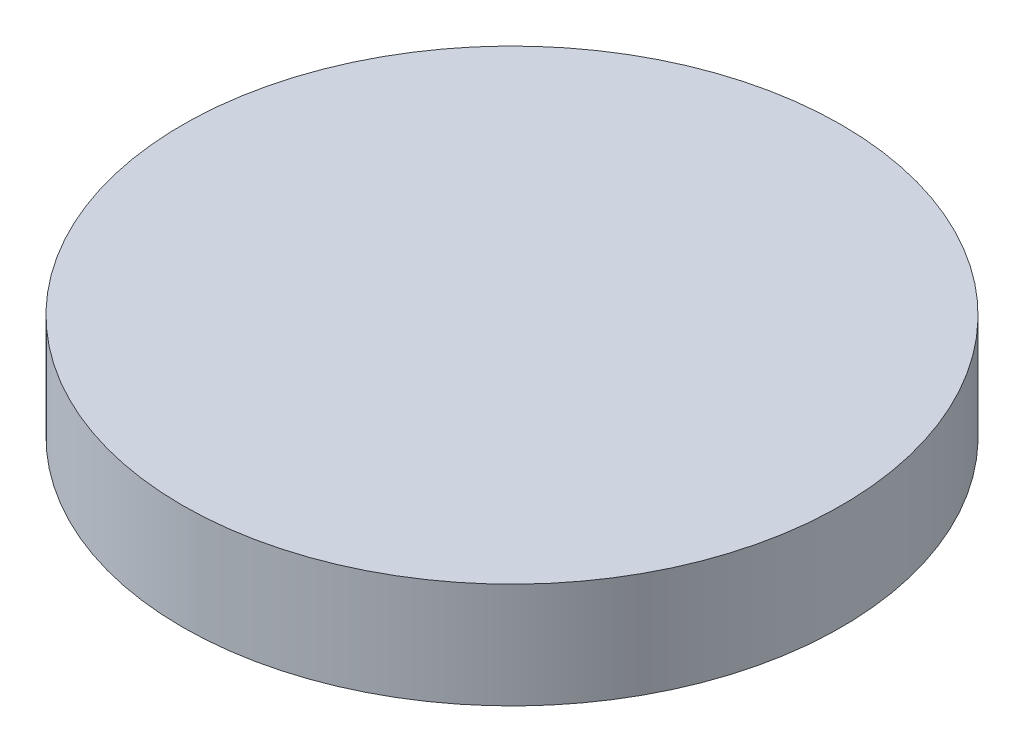
ISO-10303-21;
HEADER;
FILE_DESCRIPTION(('STEP AP214'),'2;1');
FILE_NAME('part.step','',(''),(''),'','','');
FILE_SCHEMA(('AUTOMOTIVE_DESIGN { 1 0 10303 214 1 1 1 1 }'));
ENDSEC;
DATA;
#1=APPLICATION_CONTEXT('core data for automotive mechanical design processes');
#2=APPLICATION_PROTOCOL_DEFINITION('international standard','automotive_design',2000,#1);
#3=PRODUCT_CONTEXT('',#1,'mechanical');
#4=PRODUCT('Part','Part','',(#3));
#5=PRODUCT_RELATED_PRODUCT_CATEGORY('part','',(#4));
#6=PRODUCT_DEFINITION_FORMATION('','',#4);
#7=PRODUCT_DEFINITION_CONTEXT('part definition',#1,'design');
#8=PRODUCT_DEFINITION('design','',#6,#7);
#9=PRODUCT_DEFINITION_SHAPE('','',#8);
#10=(LENGTH_UNIT() NAMED_UNIT(*) SI_UNIT(.MILLI.,.METRE.));
#11=(NAMED_UNIT(*) PLANE_ANGLE_UNIT() SI_UNIT($,.RADIAN.));
#12=(NAMED_UNIT(*) SI_UNIT($,.STERADIAN.) SOLID_ANGLE_UNIT());
#13=UNCERTAINTY_MEASURE_WITH_UNIT(LENGTH_MEASURE(1.E-05),#10,'distance_accuracy_value','');
#14=(GEOMETRIC_REPRESENTATION_CONTEXT(3) GLOBAL_UNCERTAINTY_ASSIGNED_CONTEXT((#13)) GLOBAL_UNIT_ASSIGNED_CONTEXT((#10,
#11,#12)) REPRESENTATION_CONTEXT('',''));
#15=CARTESIAN_POINT('',(0.,0.,0.));
#16=DIRECTION('',(0.,0.,1.));
#17=DIRECTION('',(1.,0.,0.));
#18=AXIS2_PLACEMENT_3D('',#15,#16,#17);
#19=CARTESIAN_POINT('',(0.,2.,0.));
#20=DIRECTION('',(0.,-1.,0.));
#21=DIRECTION('',(0.,0.,-1.));
#22=AXIS2_PLACEMENT_3D('',#19,#20,#21);
#23=CYLINDRICAL_SURFACE('',#22,6.25);
#24=CARTESIAN_POINT('',(0.,2.,0.));
#25=DIRECTION('',(0.,1.,0.));
#26=DIRECTION('',(0.,0.,1.));
#27=AXIS2_PLACEMENT_3D('',#24,#25,#26);
#28=CIRCLE('',#27,6.25);
#29=CARTESIAN_POINT('',(0.,2.,6.25));
#30=VERTEX_POINT('',#29);
#31=EDGE_CURVE('E10',#30,#30,#28,.T.);
#32=ORIENTED_EDGE('',*,*,#31,.F.);
#33=EDGE_LOOP('',(#32));
#34=FACE_BOUND('',#33,.T.);
#35=CARTESIAN_POINT('',(0.,0.,0.));
#36=DIRECTION('',(0.,1.,0.));
#37=DIRECTION('',(0.,0.,1.));
#38=AXIS2_PLACEMENT_3D('',#35,#36,#37);
#39=CIRCLE('',#38,6.25);
#40=CARTESIAN_POINT('',(0.,0.,6.25));
#41=VERTEX_POINT('',#40);
#42=EDGE_CURVE('E35',#41,#41,#39,.T.);
#43=ORIENTED_EDGE('',*,*,#42,.T.);
#44=EDGE_LOOP('',(#43));
#45=FACE_BOUND('',#44,.T.);
#46=ADVANCED_FACE('F32',(#34,#45),#23,.T.);
#47=CARTESIAN_POINT('',(0.,2.,0.));
#48=DIRECTION('',(0.,1.,0.));
#49=DIRECTION('',(0.,0.,1.));
#50=AXIS2_PLACEMENT_3D('',#47,#48,#49);
#51=PLANE('',#50);
#52=ORIENTED_EDGE('',*,*,#31,.T.);
#53=EDGE_LOOP('',(#52));
#54=FACE_BOUND('',#53,.T.);
#55=ADVANCED_FACE('F47',(#54),#51,.T.);
#56=CARTESIAN_POINT('',(0.,0.,0.));
#57=DIRECTION('',(0.,1.,0.));
#58=DIRECTION('',(0.,0.,1.));
#59=AXIS2_PLACEMENT_3D('',#56,#57,#58);
#60=PLANE('',#59);
#61=ORIENTED_EDGE('',*,*,#42,.F.);
#62=EDGE_LOOP('',(#61));
#63=FACE_BOUND('',#62,.T.);
#64=ADVANCED_FACE('F45',(#63),#60,.F.);
#65=CLOSED_SHELL('',(#46,#55,#64));
#66=MANIFOLD_SOLID_BREP('B2',#65);
#67=ADVANCED_BREP_SHAPE_REPRESENTATION('',(#18,#66),#14);
#68=SHAPE_DEFINITION_REPRESENTATION(#9,#67);
ENDSEC;
END-ISO-10303-21;
